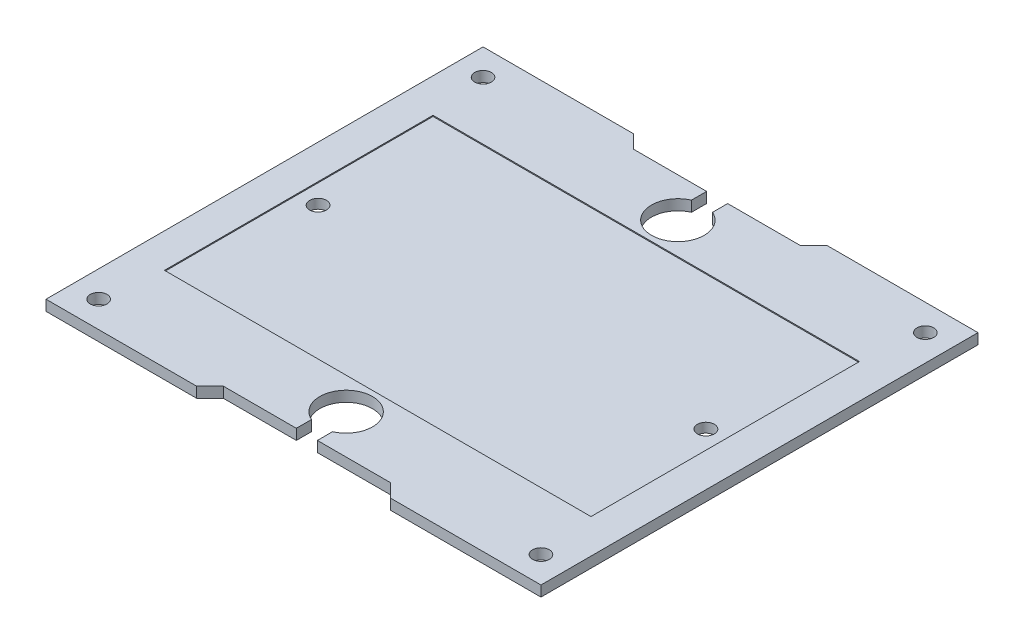
ISO-10303-21;
HEADER;
FILE_DESCRIPTION(('STEP AP214'),'2;1');
FILE_NAME('part.step','',(''),(''),'','','');
FILE_SCHEMA(('AUTOMOTIVE_DESIGN { 1 0 10303 214 1 1 1 1 }'));
ENDSEC;
DATA;
#1=APPLICATION_CONTEXT('core data for automotive mechanical design processes');
#2=APPLICATION_PROTOCOL_DEFINITION('international standard','automotive_design',2000,#1);
#3=PRODUCT_CONTEXT('',#1,'mechanical');
#4=PRODUCT('Part','Part','',(#3));
#5=PRODUCT_RELATED_PRODUCT_CATEGORY('part','',(#4));
#6=PRODUCT_DEFINITION_FORMATION('','',#4);
#7=PRODUCT_DEFINITION_CONTEXT('part definition',#1,'design');
#8=PRODUCT_DEFINITION('design','',#6,#7);
#9=PRODUCT_DEFINITION_SHAPE('','',#8);
#10=(LENGTH_UNIT() NAMED_UNIT(*) SI_UNIT(.MILLI.,.METRE.));
#11=(NAMED_UNIT(*) PLANE_ANGLE_UNIT() SI_UNIT($,.RADIAN.));
#12=(NAMED_UNIT(*) SI_UNIT($,.STERADIAN.) SOLID_ANGLE_UNIT());
#13=UNCERTAINTY_MEASURE_WITH_UNIT(LENGTH_MEASURE(1.E-05),#10,'distance_accuracy_value','');
#14=(GEOMETRIC_REPRESENTATION_CONTEXT(3) GLOBAL_UNCERTAINTY_ASSIGNED_CONTEXT((#13)) GLOBAL_UNIT_ASSIGNED_CONTEXT((#10,
#11,#12)) REPRESENTATION_CONTEXT('',''));
#15=CARTESIAN_POINT('',(0.,0.,0.));
#16=DIRECTION('',(0.,0.,1.));
#17=DIRECTION('',(1.,0.,0.));
#18=AXIS2_PLACEMENT_3D('',#15,#16,#17);
#19=CARTESIAN_POINT('',(0.,2.,0.));
#20=DIRECTION('',(0.,-1.,0.));
#21=DIRECTION('',(0.,0.,-1.));
#22=AXIS2_PLACEMENT_3D('',#19,#20,#21);
#23=PLANE('',#22);
#24=CARTESIAN_POINT('',(-42.,2.,36.5));
#25=DIRECTION('',(0.,1.,0.));
#26=DIRECTION('',(0.,0.,1.));
#27=AXIS2_PLACEMENT_3D('',#24,#25,#26);
#28=CIRCLE('',#27,1.5875);
#29=CARTESIAN_POINT('',(-42.,2.,38.0875));
#30=VERTEX_POINT('',#29);
#31=EDGE_CURVE('E416',#30,#30,#28,.T.);
#32=ORIENTED_EDGE('',*,*,#31,.F.);
#33=EDGE_LOOP('',(#32));
#34=FACE_BOUND('',#33,.T.);
#35=CARTESIAN_POINT('',(42.,2.,36.5));
#36=DIRECTION('',(0.,1.,0.));
#37=DIRECTION('',(0.,0.,1.));
#38=AXIS2_PLACEMENT_3D('',#35,#36,#37);
#39=CIRCLE('',#38,1.5875);
#40=CARTESIAN_POINT('',(42.,2.,38.0875));
#41=VERTEX_POINT('',#40);
#42=EDGE_CURVE('E424',#41,#41,#39,.T.);
#43=ORIENTED_EDGE('',*,*,#42,.F.);
#44=EDGE_LOOP('',(#43));
#45=FACE_BOUND('',#44,.T.);
#46=CARTESIAN_POINT('',(42.,2.,-36.5));
#47=DIRECTION('',(0.,1.,0.));
#48=DIRECTION('',(0.,0.,1.));
#49=AXIS2_PLACEMENT_3D('',#46,#47,#48);
#50=CIRCLE('',#49,1.5875);
#51=CARTESIAN_POINT('',(42.,2.,-34.9125));
#52=VERTEX_POINT('',#51);
#53=EDGE_CURVE('E432',#52,#52,#50,.T.);
#54=ORIENTED_EDGE('',*,*,#53,.F.);
#55=EDGE_LOOP('',(#54));
#56=FACE_BOUND('',#55,.T.);
#57=CARTESIAN_POINT('',(-42.,2.,-36.5));
#58=DIRECTION('',(0.,1.,0.));
#59=DIRECTION('',(0.,0.,1.));
#60=AXIS2_PLACEMENT_3D('',#57,#58,#59);
#61=CIRCLE('',#60,1.5875);
#62=CARTESIAN_POINT('',(-42.,2.,-34.9125));
#63=VERTEX_POINT('',#62);
#64=EDGE_CURVE('E440',#63,#63,#61,.T.);
#65=ORIENTED_EDGE('',*,*,#64,.F.);
#66=EDGE_LOOP('',(#65));
#67=FACE_BOUND('',#66,.T.);
#68=DIRECTION('',(1.,0.,0.));
#69=VECTOR('',#68,1.);
#70=CARTESIAN_POINT('',(-40.5,2.,25.5));
#71=LINE('',#70,#69);
#72=CARTESIAN_POINT('',(-40.5,2.,25.5));
#73=VERTEX_POINT('',#72);
#74=CARTESIAN_POINT('',(40.5,2.,25.5));
#75=VERTEX_POINT('',#74);
#76=EDGE_CURVE('E392',#73,#75,#71,.T.);
#77=ORIENTED_EDGE('',*,*,#76,.F.);
#78=DIRECTION('',(0.,0.,1.));
#79=VECTOR('',#78,1.);
#80=CARTESIAN_POINT('',(-40.5,2.,-25.5));
#81=LINE('',#80,#79);
#82=CARTESIAN_POINT('',(-40.5,2.,-25.5));
#83=VERTEX_POINT('',#82);
#84=EDGE_CURVE('E389',#83,#73,#81,.T.);
#85=ORIENTED_EDGE('',*,*,#84,.F.);
#86=DIRECTION('',(-1.,0.,0.));
#87=VECTOR('',#86,1.);
#88=CARTESIAN_POINT('',(-40.5,2.,-25.5));
#89=LINE('',#88,#87);
#90=CARTESIAN_POINT('',(40.5,2.,-25.5));
#91=VERTEX_POINT('',#90);
#92=EDGE_CURVE('E376',#91,#83,#89,.T.);
#93=ORIENTED_EDGE('',*,*,#92,.F.);
#94=DIRECTION('',(0.,0.,-1.));
#95=VECTOR('',#94,1.);
#96=CARTESIAN_POINT('',(40.5,2.,-25.5));
#97=LINE('',#96,#95);
#98=EDGE_CURVE('E396',#75,#91,#97,.T.);
#99=ORIENTED_EDGE('',*,*,#98,.F.);
#100=EDGE_LOOP('',(#77,#85,#93,#99));
#101=FACE_BOUND('',#100,.T.);
#102=DIRECTION('',(0.707106781186542,0.,0.707106781186553));
#103=VECTOR('',#102,1.);
#104=CARTESIAN_POINT('',(-11.5424999999999,2.,11.5424999999997));
#105=LINE('',#104,#103);
#106=CARTESIAN_POINT('',(15.875,2.,38.96));
#107=VERTEX_POINT('',#106);
#108=CARTESIAN_POINT('',(18.415,2.,41.5));
#109=VERTEX_POINT('',#108);
#110=EDGE_CURVE('E237',#107,#109,#105,.T.);
#111=ORIENTED_EDGE('',*,*,#110,.T.);
#112=DIRECTION('',(1.,0.,0.));
#113=VECTOR('',#112,1.);
#114=CARTESIAN_POINT('',(-47.,2.,41.5));
#115=LINE('',#114,#113);
#116=CARTESIAN_POINT('',(47.,2.,41.5));
#117=VERTEX_POINT('',#116);
#118=EDGE_CURVE('E461',#109,#117,#115,.T.);
#119=ORIENTED_EDGE('',*,*,#118,.T.);
#120=DIRECTION('',(0.,0.,-1.));
#121=VECTOR('',#120,1.);
#122=CARTESIAN_POINT('',(47.,2.,41.5));
#123=LINE('',#122,#121);
#124=CARTESIAN_POINT('',(47.,2.,-41.5));
#125=VERTEX_POINT('',#124);
#126=EDGE_CURVE('E448',#117,#125,#123,.T.);
#127=ORIENTED_EDGE('',*,*,#126,.T.);
#128=DIRECTION('',(-1.,0.,0.));
#129=VECTOR('',#128,1.);
#130=CARTESIAN_POINT('',(-47.,2.,-41.5));
#131=LINE('',#130,#129);
#132=CARTESIAN_POINT('',(18.415,2.,-41.5));
#133=VERTEX_POINT('',#132);
#134=EDGE_CURVE('E454',#125,#133,#131,.T.);
#135=ORIENTED_EDGE('',*,*,#134,.T.);
#136=DIRECTION('',(0.707106781186552,0.,-0.707106781186543));
#137=VECTOR('',#136,1.);
#138=CARTESIAN_POINT('',(-11.5425000000001,2.,-11.5425000000003));
#139=LINE('',#138,#137);
#140=CARTESIAN_POINT('',(15.875,2.,-38.96));
#141=VERTEX_POINT('',#140);
#142=EDGE_CURVE('E59',#141,#133,#139,.T.);
#143=ORIENTED_EDGE('',*,*,#142,.F.);
#144=DIRECTION('',(1.,0.,0.));
#145=VECTOR('',#144,1.);
#146=CARTESIAN_POINT('',(0.,2.,-38.96));
#147=LINE('',#146,#145);
#148=CARTESIAN_POINT('',(2.,2.,-38.96));
#149=VERTEX_POINT('',#148);
#150=EDGE_CURVE('E336',#149,#141,#147,.T.);
#151=ORIENTED_EDGE('',*,*,#150,.F.);
#152=DIRECTION('',(0.,0.,1.));
#153=VECTOR('',#152,1.);
#154=CARTESIAN_POINT('',(2.,2.,0.));
#155=LINE('',#154,#153);
#156=CARTESIAN_POINT('',(2.,2.,-36.0825756949558));
#157=VERTEX_POINT('',#156);
#158=EDGE_CURVE('E332',#149,#157,#155,.T.);
#159=ORIENTED_EDGE('',*,*,#158,.T.);
#160=CARTESIAN_POINT('',(0.,2.,-31.5));
#161=DIRECTION('',(0.,1.,0.));
#162=DIRECTION('',(0.,0.,1.));
#163=AXIS2_PLACEMENT_3D('',#160,#161,#162);
#164=CIRCLE('',#163,5.);
#165=CARTESIAN_POINT('',(-2.,2.,-36.0825756949558));
#166=VERTEX_POINT('',#165);
#167=EDGE_CURVE('E328',#166,#157,#164,.T.);
#168=ORIENTED_EDGE('',*,*,#167,.F.);
#169=DIRECTION('',(0.,0.,1.));
#170=VECTOR('',#169,1.);
#171=CARTESIAN_POINT('',(-2.,2.,0.));
#172=LINE('',#171,#170);
#173=CARTESIAN_POINT('',(-2.,2.,-38.96));
#174=VERTEX_POINT('',#173);
#175=EDGE_CURVE('E324',#174,#166,#172,.T.);
#176=ORIENTED_EDGE('',*,*,#175,.F.);
#177=DIRECTION('',(1.,0.,0.));
#178=VECTOR('',#177,1.);
#179=CARTESIAN_POINT('',(0.,2.,-38.96));
#180=LINE('',#179,#178);
#181=CARTESIAN_POINT('',(-15.875,2.,-38.96));
#182=VERTEX_POINT('',#181);
#183=EDGE_CURVE('E300',#182,#174,#180,.T.);
#184=ORIENTED_EDGE('',*,*,#183,.F.);
#185=DIRECTION('',(0.707106781186552,0.,0.707106781186543));
#186=VECTOR('',#185,1.);
#187=CARTESIAN_POINT('',(11.5425000000001,2.,-11.5425000000002));
#188=LINE('',#187,#186);
#189=CARTESIAN_POINT('',(-18.415,2.,-41.5));
#190=VERTEX_POINT('',#189);
#191=EDGE_CURVE('E342',#190,#182,#188,.T.);
#192=ORIENTED_EDGE('',*,*,#191,.F.);
#193=CARTESIAN_POINT('',(-47.,2.,-41.5));
#194=VERTEX_POINT('',#193);
#195=EDGE_CURVE('E452',#190,#194,#131,.T.);
#196=ORIENTED_EDGE('',*,*,#195,.T.);
#197=DIRECTION('',(0.,0.,1.));
#198=VECTOR('',#197,1.);
#199=CARTESIAN_POINT('',(-47.,2.,41.5));
#200=LINE('',#199,#198);
#201=CARTESIAN_POINT('',(-47.,2.,41.5));
#202=VERTEX_POINT('',#201);
#203=EDGE_CURVE('E458',#194,#202,#200,.T.);
#204=ORIENTED_EDGE('',*,*,#203,.T.);
#205=CARTESIAN_POINT('',(-18.415,2.,41.5));
#206=VERTEX_POINT('',#205);
#207=EDGE_CURVE('E462',#202,#206,#115,.T.);
#208=ORIENTED_EDGE('',*,*,#207,.T.);
#209=DIRECTION('',(0.707106781186546,0.,-0.707106781186549));
#210=VECTOR('',#209,1.);
#211=CARTESIAN_POINT('',(11.5425,2.,11.5424999999999));
#212=LINE('',#211,#210);
#213=CARTESIAN_POINT('',(-15.875,2.,38.96));
#214=VERTEX_POINT('',#213);
#215=EDGE_CURVE('E67',#206,#214,#212,.T.);
#216=ORIENTED_EDGE('',*,*,#215,.T.);
#217=DIRECTION('',(1.,0.,0.));
#218=VECTOR('',#217,1.);
#219=CARTESIAN_POINT('',(0.,2.,38.96));
#220=LINE('',#219,#218);
#221=CARTESIAN_POINT('',(-1.99999999999999,2.,38.96));
#222=VERTEX_POINT('',#221);
#223=EDGE_CURVE('E266',#214,#222,#220,.T.);
#224=ORIENTED_EDGE('',*,*,#223,.T.);
#225=DIRECTION('',(0.,0.,-1.));
#226=VECTOR('',#225,1.);
#227=CARTESIAN_POINT('',(-1.99999999999999,2.,0.));
#228=LINE('',#227,#226);
#229=CARTESIAN_POINT('',(-1.99999999999999,2.,36.0825756949558));
#230=VERTEX_POINT('',#229);
#231=EDGE_CURVE('E262',#222,#230,#228,.T.);
#232=ORIENTED_EDGE('',*,*,#231,.T.);
#233=CARTESIAN_POINT('',(0.,2.,31.5));
#234=DIRECTION('',(0.,1.,0.));
#235=DIRECTION('',(0.,0.,1.));
#236=AXIS2_PLACEMENT_3D('',#233,#234,#235);
#237=CIRCLE('',#236,5.);
#238=CARTESIAN_POINT('',(2.00000000000001,2.,36.0825756949558));
#239=VERTEX_POINT('',#238);
#240=EDGE_CURVE('E258',#239,#230,#237,.T.);
#241=ORIENTED_EDGE('',*,*,#240,.F.);
#242=DIRECTION('',(0.,0.,-1.));
#243=VECTOR('',#242,1.);
#244=CARTESIAN_POINT('',(2.00000000000001,2.,0.));
#245=LINE('',#244,#243);
#246=CARTESIAN_POINT('',(2.00000000000001,2.,38.96));
#247=VERTEX_POINT('',#246);
#248=EDGE_CURVE('E212',#247,#239,#245,.T.);
#249=ORIENTED_EDGE('',*,*,#248,.F.);
#250=DIRECTION('',(1.,0.,0.));
#251=VECTOR('',#250,1.);
#252=CARTESIAN_POINT('',(0.,2.,38.96));
#253=LINE('',#252,#251);
#254=EDGE_CURVE('E233',#247,#107,#253,.T.);
#255=ORIENTED_EDGE('',*,*,#254,.T.);
#256=EDGE_LOOP('',(#111,#119,#127,#135,#143,#151,#159,#168,#176,#184,#192,#196,#204,#208,#216,
#224,#232,#241,#249,#255));
#257=FACE_BOUND('',#256,.T.);
#258=ADVANCED_FACE('F41',(#34,#45,#56,#67,#101,#257),#23,.F.);
#259=CARTESIAN_POINT('',(0.,0.,0.));
#260=DIRECTION('',(0.,-1.,0.));
#261=DIRECTION('',(0.,0.,-1.));
#262=AXIS2_PLACEMENT_3D('',#259,#260,#261);
#263=PLANE('',#262);
#264=CARTESIAN_POINT('',(-36.83,0.,0.));
#265=DIRECTION('',(0.,1.,0.));
#266=DIRECTION('',(0.,0.,1.));
#267=AXIS2_PLACEMENT_3D('',#264,#265,#266);
#268=CIRCLE('',#267,1.60000000000001);
#269=CARTESIAN_POINT('',(-36.83,0.,1.60000000000001));
#270=VERTEX_POINT('',#269);
#271=EDGE_CURVE('E494',#270,#270,#268,.T.);
#272=ORIENTED_EDGE('',*,*,#271,.T.);
#273=EDGE_LOOP('',(#272));
#274=FACE_BOUND('',#273,.T.);
#275=CARTESIAN_POINT('',(36.83,0.,0.));
#276=DIRECTION('',(0.,1.,0.));
#277=DIRECTION('',(0.,0.,1.));
#278=AXIS2_PLACEMENT_3D('',#275,#276,#277);
#279=CIRCLE('',#278,1.60000000000001);
#280=CARTESIAN_POINT('',(36.83,0.,1.60000000000001));
#281=VERTEX_POINT('',#280);
#282=EDGE_CURVE('E240',#281,#281,#279,.T.);
#283=ORIENTED_EDGE('',*,*,#282,.T.);
#284=EDGE_LOOP('',(#283));
#285=FACE_BOUND('',#284,.T.);
#286=CARTESIAN_POINT('',(42.,0.,36.5));
#287=DIRECTION('',(0.,1.,0.));
#288=DIRECTION('',(0.,0.,1.));
#289=AXIS2_PLACEMENT_3D('',#286,#287,#288);
#290=CIRCLE('',#289,1.5875);
#291=CARTESIAN_POINT('',(42.,0.,38.0875));
#292=VERTEX_POINT('',#291);
#293=EDGE_CURVE('E420',#292,#292,#290,.T.);
#294=ORIENTED_EDGE('',*,*,#293,.T.);
#295=EDGE_LOOP('',(#294));
#296=FACE_BOUND('',#295,.T.);
#297=CARTESIAN_POINT('',(-42.,0.,-36.5));
#298=DIRECTION('',(0.,1.,0.));
#299=DIRECTION('',(0.,0.,1.));
#300=AXIS2_PLACEMENT_3D('',#297,#298,#299);
#301=CIRCLE('',#300,1.5875);
#302=CARTESIAN_POINT('',(-42.,0.,-34.9125));
#303=VERTEX_POINT('',#302);
#304=EDGE_CURVE('E436',#303,#303,#301,.T.);
#305=ORIENTED_EDGE('',*,*,#304,.T.);
#306=EDGE_LOOP('',(#305));
#307=FACE_BOUND('',#306,.T.);
#308=CARTESIAN_POINT('',(42.,0.,-36.5));
#309=DIRECTION('',(0.,1.,0.));
#310=DIRECTION('',(0.,0.,1.));
#311=AXIS2_PLACEMENT_3D('',#308,#309,#310);
#312=CIRCLE('',#311,1.5875);
#313=CARTESIAN_POINT('',(42.,0.,-34.9125));
#314=VERTEX_POINT('',#313);
#315=EDGE_CURVE('E428',#314,#314,#312,.T.);
#316=ORIENTED_EDGE('',*,*,#315,.T.);
#317=EDGE_LOOP('',(#316));
#318=FACE_BOUND('',#317,.T.);
#319=CARTESIAN_POINT('',(-42.,0.,36.5));
#320=DIRECTION('',(0.,1.,0.));
#321=DIRECTION('',(0.,0.,1.));
#322=AXIS2_PLACEMENT_3D('',#319,#320,#321);
#323=CIRCLE('',#322,1.5875);
#324=CARTESIAN_POINT('',(-42.,0.,38.0875));
#325=VERTEX_POINT('',#324);
#326=EDGE_CURVE('E406',#325,#325,#323,.T.);
#327=ORIENTED_EDGE('',*,*,#326,.T.);
#328=EDGE_LOOP('',(#327));
#329=FACE_BOUND('',#328,.T.);
#330=DIRECTION('',(1.,0.,0.));
#331=VECTOR('',#330,1.);
#332=CARTESIAN_POINT('',(-47.,0.,41.5));
#333=LINE('',#332,#331);
#334=CARTESIAN_POINT('',(18.415,0.,41.5));
#335=VERTEX_POINT('',#334);
#336=CARTESIAN_POINT('',(47.,0.,41.5));
#337=VERTEX_POINT('',#336);
#338=EDGE_CURVE('E478',#335,#337,#333,.T.);
#339=ORIENTED_EDGE('',*,*,#338,.F.);
#340=DIRECTION('',(0.707106781186542,0.,0.707106781186553));
#341=VECTOR('',#340,1.);
#342=CARTESIAN_POINT('',(-11.5424999999999,0.,11.5424999999997));
#343=LINE('',#342,#341);
#344=CARTESIAN_POINT('',(15.875,0.,38.96));
#345=VERTEX_POINT('',#344);
#346=EDGE_CURVE('E251',#345,#335,#343,.T.);
#347=ORIENTED_EDGE('',*,*,#346,.F.);
#348=DIRECTION('',(1.,0.,0.));
#349=VECTOR('',#348,1.);
#350=CARTESIAN_POINT('',(0.,0.,38.96));
#351=LINE('',#350,#349);
#352=CARTESIAN_POINT('',(2.00000000000001,0.,38.96));
#353=VERTEX_POINT('',#352);
#354=EDGE_CURVE('E218',#353,#345,#351,.T.);
#355=ORIENTED_EDGE('',*,*,#354,.F.);
#356=DIRECTION('',(0.,0.,-1.));
#357=VECTOR('',#356,1.);
#358=CARTESIAN_POINT('',(2.00000000000001,0.,0.));
#359=LINE('',#358,#357);
#360=CARTESIAN_POINT('',(2.00000000000001,0.,36.0825756949558));
#361=VERTEX_POINT('',#360);
#362=EDGE_CURVE('E209',#353,#361,#359,.T.);
#363=ORIENTED_EDGE('',*,*,#362,.T.);
#364=CARTESIAN_POINT('',(0.,0.,31.5));
#365=DIRECTION('',(0.,1.,0.));
#366=DIRECTION('',(0.,0.,1.));
#367=AXIS2_PLACEMENT_3D('',#364,#365,#366);
#368=CIRCLE('',#367,5.);
#369=CARTESIAN_POINT('',(-1.99999999999999,0.,36.0825756949558));
#370=VERTEX_POINT('',#369);
#371=EDGE_CURVE('E222',#361,#370,#368,.T.);
#372=ORIENTED_EDGE('',*,*,#371,.T.);
#373=DIRECTION('',(0.,0.,-1.));
#374=VECTOR('',#373,1.);
#375=CARTESIAN_POINT('',(-1.99999999999999,0.,0.));
#376=LINE('',#375,#374);
#377=CARTESIAN_POINT('',(-1.99999999999999,0.,38.96));
#378=VERTEX_POINT('',#377);
#379=EDGE_CURVE('E227',#378,#370,#376,.T.);
#380=ORIENTED_EDGE('',*,*,#379,.F.);
#381=DIRECTION('',(1.,0.,0.));
#382=VECTOR('',#381,1.);
#383=CARTESIAN_POINT('',(0.,0.,38.96));
#384=LINE('',#383,#382);
#385=CARTESIAN_POINT('',(-15.875,0.,38.96));
#386=VERTEX_POINT('',#385);
#387=EDGE_CURVE('E245',#386,#378,#384,.T.);
#388=ORIENTED_EDGE('',*,*,#387,.F.);
#389=DIRECTION('',(0.707106781186546,0.,-0.707106781186549));
#390=VECTOR('',#389,1.);
#391=CARTESIAN_POINT('',(11.5425,0.,11.5424999999999));
#392=LINE('',#391,#390);
#393=CARTESIAN_POINT('',(-18.415,0.,41.5));
#394=VERTEX_POINT('',#393);
#395=EDGE_CURVE('E248',#394,#386,#392,.T.);
#396=ORIENTED_EDGE('',*,*,#395,.F.);
#397=CARTESIAN_POINT('',(-47.,0.,41.5));
#398=VERTEX_POINT('',#397);
#399=EDGE_CURVE('E453',#398,#394,#333,.T.);
#400=ORIENTED_EDGE('',*,*,#399,.F.);
#401=DIRECTION('',(0.,0.,1.));
#402=VECTOR('',#401,1.);
#403=CARTESIAN_POINT('',(-47.,0.,41.5));
#404=LINE('',#403,#402);
#405=CARTESIAN_POINT('',(-47.,0.,-41.5));
#406=VERTEX_POINT('',#405);
#407=EDGE_CURVE('E475',#406,#398,#404,.T.);
#408=ORIENTED_EDGE('',*,*,#407,.F.);
#409=DIRECTION('',(-1.,0.,0.));
#410=VECTOR('',#409,1.);
#411=CARTESIAN_POINT('',(-47.,0.,-41.5));
#412=LINE('',#411,#410);
#413=CARTESIAN_POINT('',(-18.415,0.,-41.5));
#414=VERTEX_POINT('',#413);
#415=EDGE_CURVE('E470',#414,#406,#412,.T.);
#416=ORIENTED_EDGE('',*,*,#415,.F.);
#417=DIRECTION('',(0.707106781186552,0.,0.707106781186543));
#418=VECTOR('',#417,1.);
#419=CARTESIAN_POINT('',(11.5425000000001,0.,-11.5425000000002));
#420=LINE('',#419,#418);
#421=CARTESIAN_POINT('',(-15.875,0.,-38.96));
#422=VERTEX_POINT('',#421);
#423=EDGE_CURVE('E315',#414,#422,#420,.T.);
#424=ORIENTED_EDGE('',*,*,#423,.T.);
#425=DIRECTION('',(1.,0.,0.));
#426=VECTOR('',#425,1.);
#427=CARTESIAN_POINT('',(0.,0.,-38.96));
#428=LINE('',#427,#426);
#429=CARTESIAN_POINT('',(-2.,0.,-38.96));
#430=VERTEX_POINT('',#429);
#431=EDGE_CURVE('E319',#422,#430,#428,.T.);
#432=ORIENTED_EDGE('',*,*,#431,.T.);
#433=DIRECTION('',(0.,0.,1.));
#434=VECTOR('',#433,1.);
#435=CARTESIAN_POINT('',(-2.,0.,0.));
#436=LINE('',#435,#434);
#437=CARTESIAN_POINT('',(-2.,0.,-36.0825756949558));
#438=VERTEX_POINT('',#437);
#439=EDGE_CURVE('E295',#430,#438,#436,.T.);
#440=ORIENTED_EDGE('',*,*,#439,.T.);
#441=CARTESIAN_POINT('',(0.,0.,-31.5));
#442=DIRECTION('',(0.,1.,0.));
#443=DIRECTION('',(0.,0.,1.));
#444=AXIS2_PLACEMENT_3D('',#441,#442,#443);
#445=CIRCLE('',#444,5.);
#446=CARTESIAN_POINT('',(2.,0.,-36.0825756949558));
#447=VERTEX_POINT('',#446);
#448=EDGE_CURVE('E299',#438,#447,#445,.T.);
#449=ORIENTED_EDGE('',*,*,#448,.T.);
#450=DIRECTION('',(0.,0.,1.));
#451=VECTOR('',#450,1.);
#452=CARTESIAN_POINT('',(2.,0.,0.));
#453=LINE('',#452,#451);
#454=CARTESIAN_POINT('',(2.,0.,-38.96));
#455=VERTEX_POINT('',#454);
#456=EDGE_CURVE('E304',#455,#447,#453,.T.);
#457=ORIENTED_EDGE('',*,*,#456,.F.);
#458=DIRECTION('',(1.,0.,0.));
#459=VECTOR('',#458,1.);
#460=CARTESIAN_POINT('',(0.,0.,-38.96));
#461=LINE('',#460,#459);
#462=CARTESIAN_POINT('',(15.875,0.,-38.96));
#463=VERTEX_POINT('',#462);
#464=EDGE_CURVE('E307',#455,#463,#461,.T.);
#465=ORIENTED_EDGE('',*,*,#464,.T.);
#466=DIRECTION('',(0.707106781186552,0.,-0.707106781186543));
#467=VECTOR('',#466,1.);
#468=CARTESIAN_POINT('',(-11.5425000000001,0.,-11.5425000000003));
#469=LINE('',#468,#467);
#470=CARTESIAN_POINT('',(18.415,0.,-41.5));
#471=VERTEX_POINT('',#470);
#472=EDGE_CURVE('E311',#463,#471,#469,.T.);
#473=ORIENTED_EDGE('',*,*,#472,.T.);
#474=CARTESIAN_POINT('',(47.,0.,-41.5));
#475=VERTEX_POINT('',#474);
#476=EDGE_CURVE('E471',#475,#471,#412,.T.);
#477=ORIENTED_EDGE('',*,*,#476,.F.);
#478=DIRECTION('',(0.,0.,-1.));
#479=VECTOR('',#478,1.);
#480=CARTESIAN_POINT('',(47.,0.,41.5));
#481=LINE('',#480,#479);
#482=EDGE_CURVE('E444',#337,#475,#481,.T.);
#483=ORIENTED_EDGE('',*,*,#482,.F.);
#484=EDGE_LOOP('',(#339,#347,#355,#363,#372,#380,#388,#396,#400,#408,#416,#424,#432,#440,#449,
#457,#465,#473,#477,#483));
#485=FACE_BOUND('',#484,.T.);
#486=ADVANCED_FACE('F230',(#274,#285,#296,#307,#318,#329,#485),#263,.T.);
#487=CARTESIAN_POINT('',(-47.,2.,-41.5));
#488=DIRECTION('',(0.,0.,1.));
#489=DIRECTION('',(1.,0.,0.));
#490=AXIS2_PLACEMENT_3D('',#487,#488,#489);
#491=PLANE('',#490);
#492=ORIENTED_EDGE('',*,*,#195,.F.);
#493=DIRECTION('',(0.,1.,0.));
#494=VECTOR('',#493,1.);
#495=CARTESIAN_POINT('',(-18.415,0.,-41.5));
#496=LINE('',#495,#494);
#497=EDGE_CURVE('E354',#414,#190,#496,.T.);
#498=ORIENTED_EDGE('',*,*,#497,.F.);
#499=ORIENTED_EDGE('',*,*,#415,.T.);
#500=DIRECTION('',(0.,-1.,0.));
#501=VECTOR('',#500,1.);
#502=CARTESIAN_POINT('',(-47.,2.,-41.5));
#503=LINE('',#502,#501);
#504=EDGE_CURVE('E51',#194,#406,#503,.T.);
#505=ORIENTED_EDGE('',*,*,#504,.F.);
#506=EDGE_LOOP('',(#492,#498,#499,#505));
#507=FACE_BOUND('',#506,.T.);
#508=ADVANCED_FACE('F530',(#507),#491,.F.);
#509=CARTESIAN_POINT('',(-47.,2.,41.5));
#510=DIRECTION('',(0.,0.,-1.));
#511=DIRECTION('',(-1.,0.,0.));
#512=AXIS2_PLACEMENT_3D('',#509,#510,#511);
#513=PLANE('',#512);
#514=DIRECTION('',(0.,1.,0.));
#515=VECTOR('',#514,1.);
#516=CARTESIAN_POINT('',(18.415,0.,41.5));
#517=LINE('',#516,#515);
#518=EDGE_CURVE('E281',#335,#109,#517,.T.);
#519=ORIENTED_EDGE('',*,*,#518,.F.);
#520=ORIENTED_EDGE('',*,*,#338,.T.);
#521=DIRECTION('',(0.,-1.,0.));
#522=VECTOR('',#521,1.);
#523=CARTESIAN_POINT('',(47.,2.,41.5));
#524=LINE('',#523,#522);
#525=EDGE_CURVE('E466',#117,#337,#524,.T.);
#526=ORIENTED_EDGE('',*,*,#525,.F.);
#527=ORIENTED_EDGE('',*,*,#118,.F.);
#528=EDGE_LOOP('',(#519,#520,#526,#527));
#529=FACE_BOUND('',#528,.T.);
#530=ADVANCED_FACE('F538',(#529),#513,.F.);
#531=DIRECTION('',(0.,1.,0.));
#532=VECTOR('',#531,1.);
#533=CARTESIAN_POINT('',(-18.415,0.,41.5));
#534=LINE('',#533,#532);
#535=EDGE_CURVE('E284',#394,#206,#534,.T.);
#536=ORIENTED_EDGE('',*,*,#535,.T.);
#537=ORIENTED_EDGE('',*,*,#207,.F.);
#538=DIRECTION('',(0.,-1.,0.));
#539=VECTOR('',#538,1.);
#540=CARTESIAN_POINT('',(-47.,2.,41.5));
#541=LINE('',#540,#539);
#542=EDGE_CURVE('E485',#202,#398,#541,.T.);
#543=ORIENTED_EDGE('',*,*,#542,.T.);
#544=ORIENTED_EDGE('',*,*,#399,.T.);
#545=EDGE_LOOP('',(#536,#537,#543,#544));
#546=FACE_BOUND('',#545,.T.);
#547=ADVANCED_FACE('F541',(#546),#513,.F.);
#548=CARTESIAN_POINT('',(47.,2.,41.5));
#549=DIRECTION('',(-1.,0.,0.));
#550=DIRECTION('',(0.,0.,1.));
#551=AXIS2_PLACEMENT_3D('',#548,#549,#550);
#552=PLANE('',#551);
#553=ORIENTED_EDGE('',*,*,#482,.T.);
#554=DIRECTION('',(0.,-1.,0.));
#555=VECTOR('',#554,1.);
#556=CARTESIAN_POINT('',(47.,2.,-41.5));
#557=LINE('',#556,#555);
#558=EDGE_CURVE('E11',#125,#475,#557,.T.);
#559=ORIENTED_EDGE('',*,*,#558,.F.);
#560=ORIENTED_EDGE('',*,*,#126,.F.);
#561=ORIENTED_EDGE('',*,*,#525,.T.);
#562=EDGE_LOOP('',(#553,#559,#560,#561));
#563=FACE_BOUND('',#562,.T.);
#564=ADVANCED_FACE('F43',(#563),#552,.F.);
#565=ORIENTED_EDGE('',*,*,#476,.T.);
#566=DIRECTION('',(0.,1.,0.));
#567=VECTOR('',#566,1.);
#568=CARTESIAN_POINT('',(18.415,0.,-41.5));
#569=LINE('',#568,#567);
#570=EDGE_CURVE('E357',#471,#133,#569,.T.);
#571=ORIENTED_EDGE('',*,*,#570,.T.);
#572=ORIENTED_EDGE('',*,*,#134,.F.);
#573=ORIENTED_EDGE('',*,*,#558,.T.);
#574=EDGE_LOOP('',(#565,#571,#572,#573));
#575=FACE_BOUND('',#574,.T.);
#576=ADVANCED_FACE('F545',(#575),#491,.F.);
#577=CARTESIAN_POINT('',(-47.,2.,41.5));
#578=DIRECTION('',(1.,0.,0.));
#579=DIRECTION('',(0.,0.,-1.));
#580=AXIS2_PLACEMENT_3D('',#577,#578,#579);
#581=PLANE('',#580);
#582=ORIENTED_EDGE('',*,*,#407,.T.);
#583=ORIENTED_EDGE('',*,*,#542,.F.);
#584=ORIENTED_EDGE('',*,*,#203,.F.);
#585=ORIENTED_EDGE('',*,*,#504,.T.);
#586=EDGE_LOOP('',(#582,#583,#584,#585));
#587=FACE_BOUND('',#586,.T.);
#588=ADVANCED_FACE('F543',(#587),#581,.F.);
#589=CARTESIAN_POINT('',(-42.,2.,-36.5));
#590=DIRECTION('',(0.,-1.,0.));
#591=DIRECTION('',(0.,0.,-1.));
#592=AXIS2_PLACEMENT_3D('',#589,#590,#591);
#593=CYLINDRICAL_SURFACE('',#592,1.5875);
#594=ORIENTED_EDGE('',*,*,#64,.T.);
#595=EDGE_LOOP('',(#594));
#596=FACE_BOUND('',#595,.T.);
#597=ORIENTED_EDGE('',*,*,#304,.F.);
#598=EDGE_LOOP('',(#597));
#599=FACE_BOUND('',#598,.T.);
#600=ADVANCED_FACE('F535',(#596,#599),#593,.F.);
#601=CARTESIAN_POINT('',(42.,2.,-36.5));
#602=DIRECTION('',(0.,-1.,0.));
#603=DIRECTION('',(0.,0.,-1.));
#604=AXIS2_PLACEMENT_3D('',#601,#602,#603);
#605=CYLINDRICAL_SURFACE('',#604,1.5875);
#606=ORIENTED_EDGE('',*,*,#53,.T.);
#607=EDGE_LOOP('',(#606));
#608=FACE_BOUND('',#607,.T.);
#609=ORIENTED_EDGE('',*,*,#315,.F.);
#610=EDGE_LOOP('',(#609));
#611=FACE_BOUND('',#610,.T.);
#612=ADVANCED_FACE('F660',(#608,#611),#605,.F.);
#613=CARTESIAN_POINT('',(42.,2.,36.5));
#614=DIRECTION('',(0.,-1.,0.));
#615=DIRECTION('',(0.,0.,-1.));
#616=AXIS2_PLACEMENT_3D('',#613,#614,#615);
#617=CYLINDRICAL_SURFACE('',#616,1.5875);
#618=ORIENTED_EDGE('',*,*,#42,.T.);
#619=EDGE_LOOP('',(#618));
#620=FACE_BOUND('',#619,.T.);
#621=ORIENTED_EDGE('',*,*,#293,.F.);
#622=EDGE_LOOP('',(#621));
#623=FACE_BOUND('',#622,.T.);
#624=ADVANCED_FACE('F657',(#620,#623),#617,.F.);
#625=CARTESIAN_POINT('',(-42.,2.,36.5));
#626=DIRECTION('',(0.,-1.,0.));
#627=DIRECTION('',(0.,0.,-1.));
#628=AXIS2_PLACEMENT_3D('',#625,#626,#627);
#629=CYLINDRICAL_SURFACE('',#628,1.5875);
#630=ORIENTED_EDGE('',*,*,#31,.T.);
#631=EDGE_LOOP('',(#630));
#632=FACE_BOUND('',#631,.T.);
#633=ORIENTED_EDGE('',*,*,#326,.F.);
#634=EDGE_LOOP('',(#633));
#635=FACE_BOUND('',#634,.T.);
#636=ADVANCED_FACE('F653',(#632,#635),#629,.F.);
#637=CARTESIAN_POINT('',(-40.5,1.8,-25.5));
#638=DIRECTION('',(-1.,0.,0.));
#639=DIRECTION('',(0.,0.,1.));
#640=AXIS2_PLACEMENT_3D('',#637,#638,#639);
#641=PLANE('',#640);
#642=ORIENTED_EDGE('',*,*,#84,.T.);
#643=DIRECTION('',(0.,1.,0.));
#644=VECTOR('',#643,1.);
#645=CARTESIAN_POINT('',(-40.5,1.8,25.5));
#646=LINE('',#645,#644);
#647=CARTESIAN_POINT('',(-40.5,1.8,25.5));
#648=VERTEX_POINT('',#647);
#649=EDGE_CURVE('E388',#648,#73,#646,.T.);
#650=ORIENTED_EDGE('',*,*,#649,.F.);
#651=DIRECTION('',(0.,0.,1.));
#652=VECTOR('',#651,1.);
#653=CARTESIAN_POINT('',(-40.5,1.8,-25.5));
#654=LINE('',#653,#652);
#655=CARTESIAN_POINT('',(-40.5,1.8,-25.5));
#656=VERTEX_POINT('',#655);
#657=EDGE_CURVE('E371',#656,#648,#654,.T.);
#658=ORIENTED_EDGE('',*,*,#657,.F.);
#659=DIRECTION('',(0.,1.,0.));
#660=VECTOR('',#659,1.);
#661=CARTESIAN_POINT('',(-40.5,1.8,-25.5));
#662=LINE('',#661,#660);
#663=EDGE_CURVE('E403',#656,#83,#662,.T.);
#664=ORIENTED_EDGE('',*,*,#663,.T.);
#665=EDGE_LOOP('',(#642,#650,#658,#664));
#666=FACE_BOUND('',#665,.T.);
#667=ADVANCED_FACE('F643',(#666),#641,.F.);
#668=CARTESIAN_POINT('',(-40.5,1.8,-25.5));
#669=DIRECTION('',(0.,0.,-1.));
#670=DIRECTION('',(-1.,0.,0.));
#671=AXIS2_PLACEMENT_3D('',#668,#669,#670);
#672=PLANE('',#671);
#673=ORIENTED_EDGE('',*,*,#92,.T.);
#674=ORIENTED_EDGE('',*,*,#663,.F.);
#675=DIRECTION('',(-1.,0.,0.));
#676=VECTOR('',#675,1.);
#677=CARTESIAN_POINT('',(-40.5,1.8,-25.5));
#678=LINE('',#677,#676);
#679=CARTESIAN_POINT('',(40.5,1.8,-25.5));
#680=VERTEX_POINT('',#679);
#681=EDGE_CURVE('E384',#680,#656,#678,.T.);
#682=ORIENTED_EDGE('',*,*,#681,.F.);
#683=DIRECTION('',(0.,1.,0.));
#684=VECTOR('',#683,1.);
#685=CARTESIAN_POINT('',(40.5,1.8,-25.5));
#686=LINE('',#685,#684);
#687=EDGE_CURVE('E407',#680,#91,#686,.T.);
#688=ORIENTED_EDGE('',*,*,#687,.T.);
#689=EDGE_LOOP('',(#673,#674,#682,#688));
#690=FACE_BOUND('',#689,.T.);
#691=ADVANCED_FACE('F639',(#690),#672,.F.);
#692=CARTESIAN_POINT('',(40.5,1.8,-25.5));
#693=DIRECTION('',(1.,0.,0.));
#694=DIRECTION('',(0.,0.,-1.));
#695=AXIS2_PLACEMENT_3D('',#692,#693,#694);
#696=PLANE('',#695);
#697=ORIENTED_EDGE('',*,*,#98,.T.);
#698=ORIENTED_EDGE('',*,*,#687,.F.);
#699=DIRECTION('',(0.,0.,-1.));
#700=VECTOR('',#699,1.);
#701=CARTESIAN_POINT('',(40.5,1.8,-25.5));
#702=LINE('',#701,#700);
#703=CARTESIAN_POINT('',(40.5,1.8,25.5));
#704=VERTEX_POINT('',#703);
#705=EDGE_CURVE('E380',#704,#680,#702,.T.);
#706=ORIENTED_EDGE('',*,*,#705,.F.);
#707=DIRECTION('',(0.,1.,0.));
#708=VECTOR('',#707,1.);
#709=CARTESIAN_POINT('',(40.5,1.8,25.5));
#710=LINE('',#709,#708);
#711=EDGE_CURVE('E410',#704,#75,#710,.T.);
#712=ORIENTED_EDGE('',*,*,#711,.T.);
#713=EDGE_LOOP('',(#697,#698,#706,#712));
#714=FACE_BOUND('',#713,.T.);
#715=ADVANCED_FACE('F642',(#714),#696,.F.);
#716=CARTESIAN_POINT('',(-40.5,1.8,25.5));
#717=DIRECTION('',(0.,0.,1.));
#718=DIRECTION('',(1.,0.,0.));
#719=AXIS2_PLACEMENT_3D('',#716,#717,#718);
#720=PLANE('',#719);
#721=ORIENTED_EDGE('',*,*,#76,.T.);
#722=ORIENTED_EDGE('',*,*,#711,.F.);
#723=DIRECTION('',(1.,0.,0.));
#724=VECTOR('',#723,1.);
#725=CARTESIAN_POINT('',(-40.5,1.8,25.5));
#726=LINE('',#725,#724);
#727=EDGE_CURVE('E375',#648,#704,#726,.T.);
#728=ORIENTED_EDGE('',*,*,#727,.F.);
#729=ORIENTED_EDGE('',*,*,#649,.T.);
#730=EDGE_LOOP('',(#721,#722,#728,#729));
#731=FACE_BOUND('',#730,.T.);
#732=ADVANCED_FACE('F520',(#731),#720,.F.);
#733=CARTESIAN_POINT('',(0.,1.8,0.));
#734=DIRECTION('',(0.,1.,0.));
#735=DIRECTION('',(0.,0.,1.));
#736=AXIS2_PLACEMENT_3D('',#733,#734,#735);
#737=PLANE('',#736);
#738=CARTESIAN_POINT('',(-36.83,1.8,0.));
#739=DIRECTION('',(0.,1.,0.));
#740=DIRECTION('',(0.,0.,1.));
#741=AXIS2_PLACEMENT_3D('',#738,#739,#740);
#742=CIRCLE('',#741,1.60000000000001);
#743=CARTESIAN_POINT('',(-36.83,1.8,1.60000000000001));
#744=VERTEX_POINT('',#743);
#745=EDGE_CURVE('E45',#744,#744,#742,.T.);
#746=ORIENTED_EDGE('',*,*,#745,.F.);
#747=EDGE_LOOP('',(#746));
#748=FACE_BOUND('',#747,.T.);
#749=CARTESIAN_POINT('',(36.83,1.8,0.));
#750=DIRECTION('',(0.,1.,0.));
#751=DIRECTION('',(0.,0.,1.));
#752=AXIS2_PLACEMENT_3D('',#749,#750,#751);
#753=CIRCLE('',#752,1.60000000000001);
#754=CARTESIAN_POINT('',(36.83,1.8,1.60000000000001));
#755=VERTEX_POINT('',#754);
#756=EDGE_CURVE('E491',#755,#755,#753,.T.);
#757=ORIENTED_EDGE('',*,*,#756,.F.);
#758=EDGE_LOOP('',(#757));
#759=FACE_BOUND('',#758,.T.);
#760=ORIENTED_EDGE('',*,*,#657,.T.);
#761=ORIENTED_EDGE('',*,*,#727,.T.);
#762=ORIENTED_EDGE('',*,*,#705,.T.);
#763=ORIENTED_EDGE('',*,*,#681,.T.);
#764=EDGE_LOOP('',(#760,#761,#762,#763));
#765=FACE_BOUND('',#764,.T.);
#766=ADVANCED_FACE('F512',(#748,#759,#765),#737,.T.);
#767=CARTESIAN_POINT('',(36.83,0.,0.));
#768=DIRECTION('',(0.,1.,0.));
#769=DIRECTION('',(0.,0.,1.));
#770=AXIS2_PLACEMENT_3D('',#767,#768,#769);
#771=CYLINDRICAL_SURFACE('',#770,1.60000000000001);
#772=ORIENTED_EDGE('',*,*,#756,.T.);
#773=EDGE_LOOP('',(#772));
#774=FACE_BOUND('',#773,.T.);
#775=ORIENTED_EDGE('',*,*,#282,.F.);
#776=EDGE_LOOP('',(#775));
#777=FACE_BOUND('',#776,.T.);
#778=ADVANCED_FACE('F509',(#774,#777),#771,.F.);
#779=CARTESIAN_POINT('',(-36.83,0.,0.));
#780=DIRECTION('',(0.,1.,0.));
#781=DIRECTION('',(0.,0.,1.));
#782=AXIS2_PLACEMENT_3D('',#779,#780,#781);
#783=CYLINDRICAL_SURFACE('',#782,1.60000000000001);
#784=ORIENTED_EDGE('',*,*,#745,.T.);
#785=EDGE_LOOP('',(#784));
#786=FACE_BOUND('',#785,.T.);
#787=ORIENTED_EDGE('',*,*,#271,.F.);
#788=EDGE_LOOP('',(#787));
#789=FACE_BOUND('',#788,.T.);
#790=ADVANCED_FACE('F511',(#786,#789),#783,.F.);
#791=CARTESIAN_POINT('',(2.00000000000001,0.,0.));
#792=DIRECTION('',(1.,0.,0.));
#793=DIRECTION('',(0.,0.,-1.));
#794=AXIS2_PLACEMENT_3D('',#791,#792,#793);
#795=PLANE('',#794);
#796=ORIENTED_EDGE('',*,*,#248,.T.);
#797=DIRECTION('',(0.,1.,0.));
#798=VECTOR('',#797,1.);
#799=CARTESIAN_POINT('',(2.00000000000001,0.,36.0825756949558));
#800=LINE('',#799,#798);
#801=EDGE_CURVE('E205',#361,#239,#800,.T.);
#802=ORIENTED_EDGE('',*,*,#801,.F.);
#803=ORIENTED_EDGE('',*,*,#362,.F.);
#804=DIRECTION('',(0.,1.,0.));
#805=VECTOR('',#804,1.);
#806=CARTESIAN_POINT('',(2.00000000000001,0.,38.96));
#807=LINE('',#806,#805);
#808=EDGE_CURVE('E275',#353,#247,#807,.T.);
#809=ORIENTED_EDGE('',*,*,#808,.T.);
#810=EDGE_LOOP('',(#796,#802,#803,#809));
#811=FACE_BOUND('',#810,.T.);
#812=ADVANCED_FACE('F207',(#811),#795,.F.);
#813=CARTESIAN_POINT('',(0.,0.,38.96));
#814=DIRECTION('',(0.,0.,1.));
#815=DIRECTION('',(1.,0.,0.));
#816=AXIS2_PLACEMENT_3D('',#813,#814,#815);
#817=PLANE('',#816);
#818=ORIENTED_EDGE('',*,*,#254,.F.);
#819=ORIENTED_EDGE('',*,*,#808,.F.);
#820=ORIENTED_EDGE('',*,*,#354,.T.);
#821=DIRECTION('',(0.,1.,0.));
#822=VECTOR('',#821,1.);
#823=CARTESIAN_POINT('',(15.875,0.,38.96));
#824=LINE('',#823,#822);
#825=EDGE_CURVE('E278',#345,#107,#824,.T.);
#826=ORIENTED_EDGE('',*,*,#825,.T.);
#827=EDGE_LOOP('',(#818,#819,#820,#826));
#828=FACE_BOUND('',#827,.T.);
#829=ADVANCED_FACE('F586',(#828),#817,.T.);
#830=CARTESIAN_POINT('',(-11.5424999999999,0.,11.5424999999997));
#831=DIRECTION('',(-0.707106781186553,0.,0.707106781186542));
#832=DIRECTION('',(0.707106781186542,0.,0.707106781186553));
#833=AXIS2_PLACEMENT_3D('',#830,#831,#832);
#834=PLANE('',#833);
#835=ORIENTED_EDGE('',*,*,#110,.F.);
#836=ORIENTED_EDGE('',*,*,#825,.F.);
#837=ORIENTED_EDGE('',*,*,#346,.T.);
#838=ORIENTED_EDGE('',*,*,#518,.T.);
#839=EDGE_LOOP('',(#835,#836,#837,#838));
#840=FACE_BOUND('',#839,.T.);
#841=ADVANCED_FACE('F589',(#840),#834,.T.);
#842=CARTESIAN_POINT('',(11.5425,0.,11.5424999999999));
#843=DIRECTION('',(0.707106781186549,0.,0.707106781186546));
#844=DIRECTION('',(0.707106781186546,0.,-0.707106781186549));
#845=AXIS2_PLACEMENT_3D('',#842,#843,#844);
#846=PLANE('',#845);
#847=ORIENTED_EDGE('',*,*,#215,.F.);
#848=ORIENTED_EDGE('',*,*,#535,.F.);
#849=ORIENTED_EDGE('',*,*,#395,.T.);
#850=DIRECTION('',(0.,1.,0.));
#851=VECTOR('',#850,1.);
#852=CARTESIAN_POINT('',(-15.875,0.,38.96));
#853=LINE('',#852,#851);
#854=EDGE_CURVE('E287',#386,#214,#853,.T.);
#855=ORIENTED_EDGE('',*,*,#854,.T.);
#856=EDGE_LOOP('',(#847,#848,#849,#855));
#857=FACE_BOUND('',#856,.T.);
#858=ADVANCED_FACE('F811',(#857),#846,.T.);
#859=CARTESIAN_POINT('',(0.,0.,38.96));
#860=DIRECTION('',(0.,0.,1.));
#861=DIRECTION('',(1.,0.,0.));
#862=AXIS2_PLACEMENT_3D('',#859,#860,#861);
#863=PLANE('',#862);
#864=ORIENTED_EDGE('',*,*,#223,.F.);
#865=ORIENTED_EDGE('',*,*,#854,.F.);
#866=ORIENTED_EDGE('',*,*,#387,.T.);
#867=DIRECTION('',(0.,1.,0.));
#868=VECTOR('',#867,1.);
#869=CARTESIAN_POINT('',(-1.99999999999999,0.,38.96));
#870=LINE('',#869,#868);
#871=EDGE_CURVE('E290',#378,#222,#870,.T.);
#872=ORIENTED_EDGE('',*,*,#871,.T.);
#873=EDGE_LOOP('',(#864,#865,#866,#872));
#874=FACE_BOUND('',#873,.T.);
#875=ADVANCED_FACE('F578',(#874),#863,.T.);
#876=CARTESIAN_POINT('',(-1.99999999999999,0.,0.));
#877=DIRECTION('',(1.,0.,0.));
#878=DIRECTION('',(0.,0.,-1.));
#879=AXIS2_PLACEMENT_3D('',#876,#877,#878);
#880=PLANE('',#879);
#881=ORIENTED_EDGE('',*,*,#231,.F.);
#882=ORIENTED_EDGE('',*,*,#871,.F.);
#883=ORIENTED_EDGE('',*,*,#379,.T.);
#884=DIRECTION('',(0.,1.,0.));
#885=VECTOR('',#884,1.);
#886=CARTESIAN_POINT('',(-1.99999999999999,0.,36.0825756949558));
#887=LINE('',#886,#885);
#888=EDGE_CURVE('E217',#370,#230,#887,.T.);
#889=ORIENTED_EDGE('',*,*,#888,.T.);
#890=EDGE_LOOP('',(#881,#882,#883,#889));
#891=FACE_BOUND('',#890,.T.);
#892=ADVANCED_FACE('F581',(#891),#880,.T.);
#893=CARTESIAN_POINT('',(0.,0.,31.5));
#894=DIRECTION('',(0.,1.,0.));
#895=DIRECTION('',(0.,0.,1.));
#896=AXIS2_PLACEMENT_3D('',#893,#894,#895);
#897=CYLINDRICAL_SURFACE('',#896,5.);
#898=ORIENTED_EDGE('',*,*,#240,.T.);
#899=ORIENTED_EDGE('',*,*,#888,.F.);
#900=ORIENTED_EDGE('',*,*,#371,.F.);
#901=ORIENTED_EDGE('',*,*,#801,.T.);
#902=EDGE_LOOP('',(#898,#899,#900,#901));
#903=FACE_BOUND('',#902,.T.);
#904=ADVANCED_FACE('F223',(#903),#897,.F.);
#905=CARTESIAN_POINT('',(-2.,0.,0.));
#906=DIRECTION('',(-1.,0.,0.));
#907=DIRECTION('',(0.,0.,1.));
#908=AXIS2_PLACEMENT_3D('',#905,#906,#907);
#909=PLANE('',#908);
#910=ORIENTED_EDGE('',*,*,#175,.T.);
#911=DIRECTION('',(0.,1.,0.));
#912=VECTOR('',#911,1.);
#913=CARTESIAN_POINT('',(-2.,0.,-36.0825756949558));
#914=LINE('',#913,#912);
#915=EDGE_CURVE('E323',#438,#166,#914,.T.);
#916=ORIENTED_EDGE('',*,*,#915,.F.);
#917=ORIENTED_EDGE('',*,*,#439,.F.);
#918=DIRECTION('',(0.,1.,0.));
#919=VECTOR('',#918,1.);
#920=CARTESIAN_POINT('',(-2.,0.,-38.96));
#921=LINE('',#920,#919);
#922=EDGE_CURVE('E259',#430,#174,#921,.T.);
#923=ORIENTED_EDGE('',*,*,#922,.T.);
#924=EDGE_LOOP('',(#910,#916,#917,#923));
#925=FACE_BOUND('',#924,.T.);
#926=ADVANCED_FACE('F614',(#925),#909,.F.);
#927=CARTESIAN_POINT('',(0.,0.,-38.96));
#928=DIRECTION('',(0.,0.,1.));
#929=DIRECTION('',(1.,0.,0.));
#930=AXIS2_PLACEMENT_3D('',#927,#928,#929);
#931=PLANE('',#930);
#932=ORIENTED_EDGE('',*,*,#183,.T.);
#933=ORIENTED_EDGE('',*,*,#922,.F.);
#934=ORIENTED_EDGE('',*,*,#431,.F.);
#935=DIRECTION('',(0.,1.,0.));
#936=VECTOR('',#935,1.);
#937=CARTESIAN_POINT('',(-15.875,0.,-38.96));
#938=LINE('',#937,#936);
#939=EDGE_CURVE('E351',#422,#182,#938,.T.);
#940=ORIENTED_EDGE('',*,*,#939,.T.);
#941=EDGE_LOOP('',(#932,#933,#934,#940));
#942=FACE_BOUND('',#941,.T.);
#943=ADVANCED_FACE('F617',(#942),#931,.F.);
#944=CARTESIAN_POINT('',(11.5425000000001,0.,-11.5425000000002));
#945=DIRECTION('',(-0.707106781186543,0.,0.707106781186552));
#946=DIRECTION('',(0.707106781186552,0.,0.707106781186543));
#947=AXIS2_PLACEMENT_3D('',#944,#945,#946);
#948=PLANE('',#947);
#949=ORIENTED_EDGE('',*,*,#191,.T.);
#950=ORIENTED_EDGE('',*,*,#939,.F.);
#951=ORIENTED_EDGE('',*,*,#423,.F.);
#952=ORIENTED_EDGE('',*,*,#497,.T.);
#953=EDGE_LOOP('',(#949,#950,#951,#952));
#954=FACE_BOUND('',#953,.T.);
#955=ADVANCED_FACE('F620',(#954),#948,.F.);
#956=CARTESIAN_POINT('',(-11.5425000000001,0.,-11.5425000000003));
#957=DIRECTION('',(0.707106781186543,0.,0.707106781186552));
#958=DIRECTION('',(0.707106781186552,0.,-0.707106781186543));
#959=AXIS2_PLACEMENT_3D('',#956,#957,#958);
#960=PLANE('',#959);
#961=ORIENTED_EDGE('',*,*,#142,.T.);
#962=ORIENTED_EDGE('',*,*,#570,.F.);
#963=ORIENTED_EDGE('',*,*,#472,.F.);
#964=DIRECTION('',(0.,1.,0.));
#965=VECTOR('',#964,1.);
#966=CARTESIAN_POINT('',(15.875,0.,-38.96));
#967=LINE('',#966,#965);
#968=EDGE_CURVE('E360',#463,#141,#967,.T.);
#969=ORIENTED_EDGE('',*,*,#968,.T.);
#970=EDGE_LOOP('',(#961,#962,#963,#969));
#971=FACE_BOUND('',#970,.T.);
#972=ADVANCED_FACE('F598',(#971),#960,.F.);
#973=CARTESIAN_POINT('',(0.,0.,-38.96));
#974=DIRECTION('',(0.,0.,1.));
#975=DIRECTION('',(1.,0.,0.));
#976=AXIS2_PLACEMENT_3D('',#973,#974,#975);
#977=PLANE('',#976);
#978=ORIENTED_EDGE('',*,*,#150,.T.);
#979=ORIENTED_EDGE('',*,*,#968,.F.);
#980=ORIENTED_EDGE('',*,*,#464,.F.);
#981=DIRECTION('',(0.,1.,0.));
#982=VECTOR('',#981,1.);
#983=CARTESIAN_POINT('',(2.,0.,-38.96));
#984=LINE('',#983,#982);
#985=EDGE_CURVE('E363',#455,#149,#984,.T.);
#986=ORIENTED_EDGE('',*,*,#985,.T.);
#987=EDGE_LOOP('',(#978,#979,#980,#986));
#988=FACE_BOUND('',#987,.T.);
#989=ADVANCED_FACE('F602',(#988),#977,.F.);
#990=CARTESIAN_POINT('',(2.,0.,0.));
#991=DIRECTION('',(-1.,0.,0.));
#992=DIRECTION('',(0.,0.,1.));
#993=AXIS2_PLACEMENT_3D('',#990,#991,#992);
#994=PLANE('',#993);
#995=ORIENTED_EDGE('',*,*,#158,.F.);
#996=ORIENTED_EDGE('',*,*,#985,.F.);
#997=ORIENTED_EDGE('',*,*,#456,.T.);
#998=DIRECTION('',(0.,1.,0.));
#999=VECTOR('',#998,1.);
#1000=CARTESIAN_POINT('',(2.,0.,-36.0825756949558));
#1001=LINE('',#1000,#999);
#1002=EDGE_CURVE('E366',#447,#157,#1001,.T.);
#1003=ORIENTED_EDGE('',*,*,#1002,.T.);
#1004=EDGE_LOOP('',(#995,#996,#997,#1003));
#1005=FACE_BOUND('',#1004,.T.);
#1006=ADVANCED_FACE('F607',(#1005),#994,.T.);
#1007=CARTESIAN_POINT('',(0.,0.,-31.5));
#1008=DIRECTION('',(0.,1.,0.));
#1009=DIRECTION('',(0.,0.,1.));
#1010=AXIS2_PLACEMENT_3D('',#1007,#1008,#1009);
#1011=CYLINDRICAL_SURFACE('',#1010,5.);
#1012=ORIENTED_EDGE('',*,*,#167,.T.);
#1013=ORIENTED_EDGE('',*,*,#1002,.F.);
#1014=ORIENTED_EDGE('',*,*,#448,.F.);
#1015=ORIENTED_EDGE('',*,*,#915,.T.);
#1016=EDGE_LOOP('',(#1012,#1013,#1014,#1015));
#1017=FACE_BOUND('',#1016,.T.);
#1018=ADVANCED_FACE('F611',(#1017),#1011,.F.);
#1019=CLOSED_SHELL('',(#258,#486,#508,#530,#547,#564,#576,#588,#600,#612,#624,#636,#667,#691,
#715,#732,#766,#778,#790,#812,#829,#841,#858,#875,#892,#904,#926,#943,#955,#972,#989,#1006,#1018));
#1020=MANIFOLD_SOLID_BREP('B2',#1019);
#1021=ADVANCED_BREP_SHAPE_REPRESENTATION('',(#18,#1020),#14);
#1022=SHAPE_DEFINITION_REPRESENTATION(#9,#1021);
ENDSEC;
END-ISO-10303-21;
